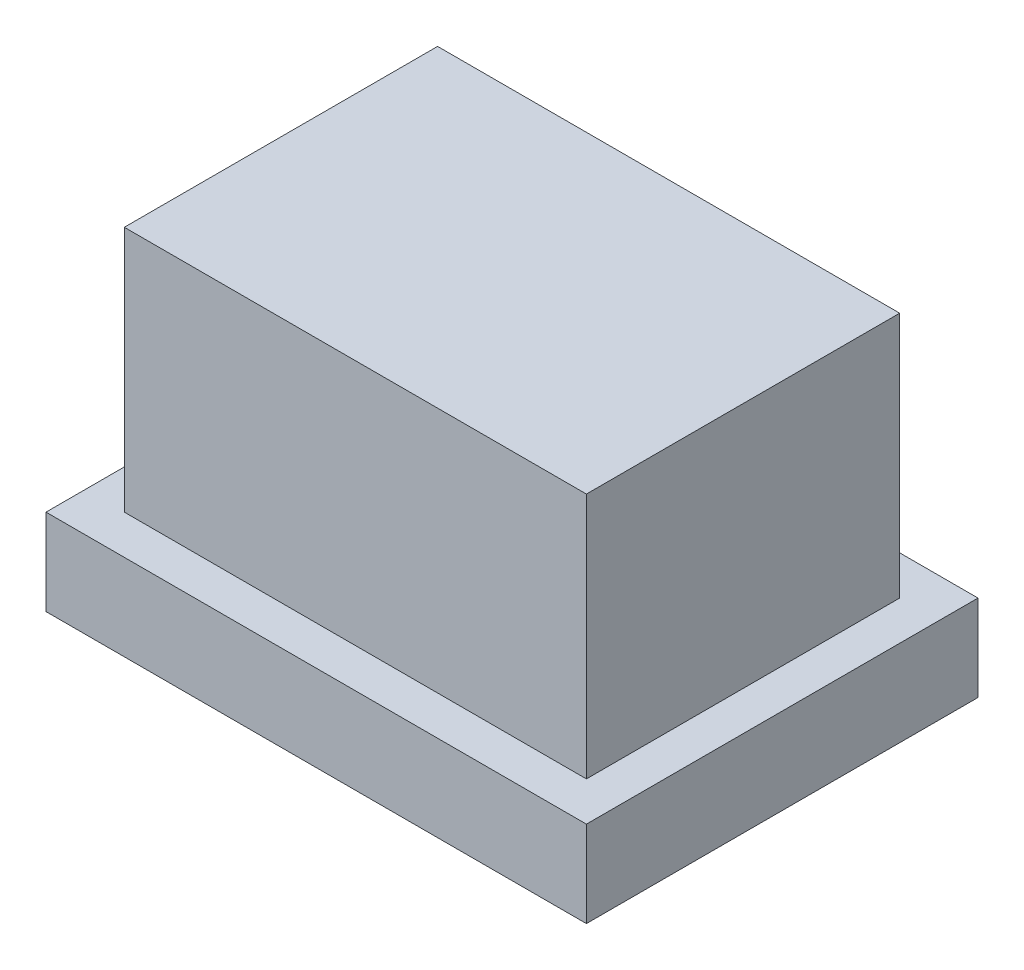
ISO-10303-21;
HEADER;
FILE_DESCRIPTION(('STEP AP214'),'2;1');
FILE_NAME('part.step','',(''),(''),'','','');
FILE_SCHEMA(('AUTOMOTIVE_DESIGN { 1 0 10303 214 1 1 1 1 }'));
ENDSEC;
DATA;
#1=APPLICATION_CONTEXT('core data for automotive mechanical design processes');
#2=APPLICATION_PROTOCOL_DEFINITION('international standard','automotive_design',2000,#1);
#3=PRODUCT_CONTEXT('',#1,'mechanical');
#4=PRODUCT('Part','Part','',(#3));
#5=PRODUCT_RELATED_PRODUCT_CATEGORY('part','',(#4));
#6=PRODUCT_DEFINITION_FORMATION('','',#4);
#7=PRODUCT_DEFINITION_CONTEXT('part definition',#1,'design');
#8=PRODUCT_DEFINITION('design','',#6,#7);
#9=PRODUCT_DEFINITION_SHAPE('','',#8);
#10=(LENGTH_UNIT() NAMED_UNIT(*) SI_UNIT(.MILLI.,.METRE.));
#11=(NAMED_UNIT(*) PLANE_ANGLE_UNIT() SI_UNIT($,.RADIAN.));
#12=(NAMED_UNIT(*) SI_UNIT($,.STERADIAN.) SOLID_ANGLE_UNIT());
#13=UNCERTAINTY_MEASURE_WITH_UNIT(LENGTH_MEASURE(1.E-05),#10,'distance_accuracy_value','');
#14=(GEOMETRIC_REPRESENTATION_CONTEXT(3) GLOBAL_UNCERTAINTY_ASSIGNED_CONTEXT((#13)) GLOBAL_UNIT_ASSIGNED_CONTEXT((#10,
#11,#12)) REPRESENTATION_CONTEXT('',''));
#15=CARTESIAN_POINT('',(0.,0.,0.));
#16=DIRECTION('',(0.,0.,1.));
#17=DIRECTION('',(1.,0.,0.));
#18=AXIS2_PLACEMENT_3D('',#15,#16,#17);
#19=CARTESIAN_POINT('',(6.24469273743017,2.2,4.21787709497206));
#20=DIRECTION('',(-1.,0.,0.));
#21=DIRECTION('',(0.,0.,1.));
#22=AXIS2_PLACEMENT_3D('',#19,#20,#21);
#23=PLANE('',#22);
#24=DIRECTION('',(0.,0.,-1.));
#25=VECTOR('',#24,1.);
#26=CARTESIAN_POINT('',(6.24469273743017,0.,4.21787709497206));
#27=LINE('',#26,#25);
#28=CARTESIAN_POINT('',(6.24469273743017,0.,4.21787709497206));
#29=VERTEX_POINT('',#28);
#30=CARTESIAN_POINT('',(6.24469273743017,0.,-5.78212290502794));
#31=VERTEX_POINT('',#30);
#32=EDGE_CURVE('E127',#29,#31,#27,.T.);
#33=ORIENTED_EDGE('',*,*,#32,.T.);
#34=DIRECTION('',(0.,-1.,0.));
#35=VECTOR('',#34,1.);
#36=CARTESIAN_POINT('',(6.24469273743017,2.2,-5.78212290502794));
#37=LINE('',#36,#35);
#38=CARTESIAN_POINT('',(6.24469273743017,2.2,-5.78212290502794));
#39=VERTEX_POINT('',#38);
#40=EDGE_CURVE('E11',#39,#31,#37,.T.);
#41=ORIENTED_EDGE('',*,*,#40,.F.);
#42=DIRECTION('',(0.,0.,-1.));
#43=VECTOR('',#42,1.);
#44=CARTESIAN_POINT('',(6.24469273743017,2.2,4.21787709497206));
#45=LINE('',#44,#43);
#46=CARTESIAN_POINT('',(6.24469273743017,2.2,4.21787709497206));
#47=VERTEX_POINT('',#46);
#48=EDGE_CURVE('E138',#47,#39,#45,.T.);
#49=ORIENTED_EDGE('',*,*,#48,.F.);
#50=DIRECTION('',(0.,-1.,0.));
#51=VECTOR('',#50,1.);
#52=CARTESIAN_POINT('',(6.24469273743017,2.2,4.21787709497206));
#53=LINE('',#52,#51);
#54=EDGE_CURVE('E151',#47,#29,#53,.T.);
#55=ORIENTED_EDGE('',*,*,#54,.T.);
#56=EDGE_LOOP('',(#33,#41,#49,#55));
#57=FACE_BOUND('',#56,.T.);
#58=ADVANCED_FACE('F39',(#57),#23,.F.);
#59=CARTESIAN_POINT('',(6.24469273743017,2.2,-5.78212290502794));
#60=DIRECTION('',(0.,0.,1.));
#61=DIRECTION('',(1.,0.,0.));
#62=AXIS2_PLACEMENT_3D('',#59,#60,#61);
#63=PLANE('',#62);
#64=DIRECTION('',(-1.,0.,0.));
#65=VECTOR('',#64,1.);
#66=CARTESIAN_POINT('',(6.24469273743017,0.,-5.78212290502794));
#67=LINE('',#66,#65);
#68=CARTESIAN_POINT('',(-7.55530726256983,0.,-5.78212290502794));
#69=VERTEX_POINT('',#68);
#70=EDGE_CURVE('E132',#31,#69,#67,.T.);
#71=ORIENTED_EDGE('',*,*,#70,.T.);
#72=DIRECTION('',(0.,-1.,0.));
#73=VECTOR('',#72,1.);
#74=CARTESIAN_POINT('',(-7.55530726256983,2.2,-5.78212290502794));
#75=LINE('',#74,#73);
#76=CARTESIAN_POINT('',(-7.55530726256983,2.2,-5.78212290502794));
#77=VERTEX_POINT('',#76);
#78=EDGE_CURVE('E47',#77,#69,#75,.T.);
#79=ORIENTED_EDGE('',*,*,#78,.F.);
#80=DIRECTION('',(-1.,0.,0.));
#81=VECTOR('',#80,1.);
#82=CARTESIAN_POINT('',(6.24469273743017,2.2,-5.78212290502794));
#83=LINE('',#82,#81);
#84=EDGE_CURVE('E142',#39,#77,#83,.T.);
#85=ORIENTED_EDGE('',*,*,#84,.F.);
#86=ORIENTED_EDGE('',*,*,#40,.T.);
#87=EDGE_LOOP('',(#71,#79,#85,#86));
#88=FACE_BOUND('',#87,.T.);
#89=ADVANCED_FACE('F188',(#88),#63,.F.);
#90=CARTESIAN_POINT('',(-7.55530726256983,2.2,4.21787709497206));
#91=DIRECTION('',(1.,0.,0.));
#92=DIRECTION('',(0.,0.,-1.));
#93=AXIS2_PLACEMENT_3D('',#90,#91,#92);
#94=PLANE('',#93);
#95=DIRECTION('',(0.,0.,1.));
#96=VECTOR('',#95,1.);
#97=CARTESIAN_POINT('',(-7.55530726256983,0.,4.21787709497206));
#98=LINE('',#97,#96);
#99=CARTESIAN_POINT('',(-7.55530726256983,0.,4.21787709497206));
#100=VERTEX_POINT('',#99);
#101=EDGE_CURVE('E155',#69,#100,#98,.T.);
#102=ORIENTED_EDGE('',*,*,#101,.T.);
#103=DIRECTION('',(0.,-1.,0.));
#104=VECTOR('',#103,1.);
#105=CARTESIAN_POINT('',(-7.55530726256983,2.2,4.21787709497206));
#106=LINE('',#105,#104);
#107=CARTESIAN_POINT('',(-7.55530726256983,2.2,4.21787709497206));
#108=VERTEX_POINT('',#107);
#109=EDGE_CURVE('E163',#108,#100,#106,.T.);
#110=ORIENTED_EDGE('',*,*,#109,.F.);
#111=DIRECTION('',(0.,0.,1.));
#112=VECTOR('',#111,1.);
#113=CARTESIAN_POINT('',(-7.55530726256983,2.2,4.21787709497206));
#114=LINE('',#113,#112);
#115=EDGE_CURVE('E146',#77,#108,#114,.T.);
#116=ORIENTED_EDGE('',*,*,#115,.F.);
#117=ORIENTED_EDGE('',*,*,#78,.T.);
#118=EDGE_LOOP('',(#102,#110,#116,#117));
#119=FACE_BOUND('',#118,.T.);
#120=ADVANCED_FACE('F172',(#119),#94,.F.);
#121=CARTESIAN_POINT('',(6.24469273743017,2.2,4.21787709497206));
#122=DIRECTION('',(0.,0.,-1.));
#123=DIRECTION('',(-1.,0.,0.));
#124=AXIS2_PLACEMENT_3D('',#121,#122,#123);
#125=PLANE('',#124);
#126=DIRECTION('',(1.,0.,0.));
#127=VECTOR('',#126,1.);
#128=CARTESIAN_POINT('',(6.24469273743017,0.,4.21787709497206));
#129=LINE('',#128,#127);
#130=EDGE_CURVE('E143',#100,#29,#129,.T.);
#131=ORIENTED_EDGE('',*,*,#130,.T.);
#132=ORIENTED_EDGE('',*,*,#54,.F.);
#133=DIRECTION('',(1.,0.,0.));
#134=VECTOR('',#133,1.);
#135=CARTESIAN_POINT('',(6.24469273743017,2.2,4.21787709497206));
#136=LINE('',#135,#134);
#137=EDGE_CURVE('E149',#108,#47,#136,.T.);
#138=ORIENTED_EDGE('',*,*,#137,.F.);
#139=ORIENTED_EDGE('',*,*,#109,.T.);
#140=EDGE_LOOP('',(#131,#132,#138,#139));
#141=FACE_BOUND('',#140,.T.);
#142=ADVANCED_FACE('F181',(#141),#125,.F.);
#143=CARTESIAN_POINT('',(0.,2.2,0.));
#144=DIRECTION('',(0.,1.,0.));
#145=DIRECTION('',(0.,0.,1.));
#146=AXIS2_PLACEMENT_3D('',#143,#144,#145);
#147=PLANE('',#146);
#148=DIRECTION('',(1.,0.,0.));
#149=VECTOR('',#148,1.);
#150=CARTESIAN_POINT('',(-6.55530726256983,2.2,3.21787709497206));
#151=LINE('',#150,#149);
#152=CARTESIAN_POINT('',(-6.55530726256983,2.2,3.21787709497206));
#153=VERTEX_POINT('',#152);
#154=CARTESIAN_POINT('',(5.24469273743017,2.2,3.21787709497206));
#155=VERTEX_POINT('',#154);
#156=EDGE_CURVE('E54',#153,#155,#151,.T.);
#157=ORIENTED_EDGE('',*,*,#156,.F.);
#158=DIRECTION('',(0.,0.,1.));
#159=VECTOR('',#158,1.);
#160=CARTESIAN_POINT('',(-6.55530726256983,2.2,-4.78212290502794));
#161=LINE('',#160,#159);
#162=CARTESIAN_POINT('',(-6.55530726256983,2.2,-4.78212290502794));
#163=VERTEX_POINT('',#162);
#164=EDGE_CURVE('E58',#163,#153,#161,.T.);
#165=ORIENTED_EDGE('',*,*,#164,.F.);
#166=DIRECTION('',(-1.,0.,0.));
#167=VECTOR('',#166,1.);
#168=CARTESIAN_POINT('',(5.24469273743017,2.2,-4.78212290502794));
#169=LINE('',#168,#167);
#170=CARTESIAN_POINT('',(5.24469273743017,2.2,-4.78212290502794));
#171=VERTEX_POINT('',#170);
#172=EDGE_CURVE('E246',#171,#163,#169,.T.);
#173=ORIENTED_EDGE('',*,*,#172,.F.);
#174=DIRECTION('',(0.,0.,-1.));
#175=VECTOR('',#174,1.);
#176=CARTESIAN_POINT('',(5.24469273743017,2.2,3.21787709497206));
#177=LINE('',#176,#175);
#178=EDGE_CURVE('E234',#155,#171,#177,.T.);
#179=ORIENTED_EDGE('',*,*,#178,.F.);
#180=EDGE_LOOP('',(#157,#165,#173,#179));
#181=FACE_BOUND('',#180,.T.);
#182=ORIENTED_EDGE('',*,*,#48,.T.);
#183=ORIENTED_EDGE('',*,*,#84,.T.);
#184=ORIENTED_EDGE('',*,*,#115,.T.);
#185=ORIENTED_EDGE('',*,*,#137,.T.);
#186=EDGE_LOOP('',(#182,#183,#184,#185));
#187=FACE_BOUND('',#186,.T.);
#188=ADVANCED_FACE('F187',(#181,#187),#147,.T.);
#189=CARTESIAN_POINT('',(0.,0.,0.));
#190=DIRECTION('',(0.,1.,0.));
#191=DIRECTION('',(0.,0.,1.));
#192=AXIS2_PLACEMENT_3D('',#189,#190,#191);
#193=PLANE('',#192);
#194=CARTESIAN_POINT('',(-0.655307262569832,0.,-0.782122905027936));
#195=DIRECTION('',(0.,-1.,0.));
#196=DIRECTION('',(0.,0.,-1.));
#197=AXIS2_PLACEMENT_3D('',#194,#195,#196);
#198=CIRCLE('',#197,3.5);
#199=CARTESIAN_POINT('',(-0.655307262569832,0.,-4.28212290502794));
#200=VERTEX_POINT('',#199);
#201=EDGE_CURVE('E230',#200,#200,#198,.T.);
#202=ORIENTED_EDGE('',*,*,#201,.F.);
#203=EDGE_LOOP('',(#202));
#204=FACE_BOUND('',#203,.T.);
#205=ORIENTED_EDGE('',*,*,#32,.F.);
#206=ORIENTED_EDGE('',*,*,#130,.F.);
#207=ORIENTED_EDGE('',*,*,#101,.F.);
#208=ORIENTED_EDGE('',*,*,#70,.F.);
#209=EDGE_LOOP('',(#205,#206,#207,#208));
#210=FACE_BOUND('',#209,.T.);
#211=ADVANCED_FACE('F178',(#204,#210),#193,.F.);
#212=CARTESIAN_POINT('',(-6.55530726256983,8.5,3.21787709497206));
#213=DIRECTION('',(0.,0.,-1.));
#214=DIRECTION('',(-1.,0.,0.));
#215=AXIS2_PLACEMENT_3D('',#212,#213,#214);
#216=PLANE('',#215);
#217=ORIENTED_EDGE('',*,*,#156,.T.);
#218=DIRECTION('',(0.,-1.,0.));
#219=VECTOR('',#218,1.);
#220=CARTESIAN_POINT('',(5.24469273743017,8.5,3.21787709497206));
#221=LINE('',#220,#219);
#222=CARTESIAN_POINT('',(5.24469273743017,8.5,3.21787709497206));
#223=VERTEX_POINT('',#222);
#224=EDGE_CURVE('E107',#223,#155,#221,.T.);
#225=ORIENTED_EDGE('',*,*,#224,.F.);
#226=DIRECTION('',(1.,0.,0.));
#227=VECTOR('',#226,1.);
#228=CARTESIAN_POINT('',(-6.55530726256983,8.5,3.21787709497206));
#229=LINE('',#228,#227);
#230=CARTESIAN_POINT('',(-6.55530726256983,8.5,3.21787709497206));
#231=VERTEX_POINT('',#230);
#232=EDGE_CURVE('E114',#231,#223,#229,.T.);
#233=ORIENTED_EDGE('',*,*,#232,.F.);
#234=DIRECTION('',(0.,-1.,0.));
#235=VECTOR('',#234,1.);
#236=CARTESIAN_POINT('',(-6.55530726256983,8.5,3.21787709497206));
#237=LINE('',#236,#235);
#238=EDGE_CURVE('E242',#231,#153,#237,.T.);
#239=ORIENTED_EDGE('',*,*,#238,.T.);
#240=EDGE_LOOP('',(#217,#225,#233,#239));
#241=FACE_BOUND('',#240,.T.);
#242=ADVANCED_FACE('F125',(#241),#216,.F.);
#243=CARTESIAN_POINT('',(5.24469273743017,8.5,3.21787709497206));
#244=DIRECTION('',(-1.,0.,0.));
#245=DIRECTION('',(0.,0.,1.));
#246=AXIS2_PLACEMENT_3D('',#243,#244,#245);
#247=PLANE('',#246);
#248=ORIENTED_EDGE('',*,*,#178,.T.);
#249=DIRECTION('',(0.,-1.,0.));
#250=VECTOR('',#249,1.);
#251=CARTESIAN_POINT('',(5.24469273743017,8.5,-4.78212290502794));
#252=LINE('',#251,#250);
#253=CARTESIAN_POINT('',(5.24469273743017,8.5,-4.78212290502794));
#254=VERTEX_POINT('',#253);
#255=EDGE_CURVE('E109',#254,#171,#252,.T.);
#256=ORIENTED_EDGE('',*,*,#255,.F.);
#257=DIRECTION('',(0.,0.,-1.));
#258=VECTOR('',#257,1.);
#259=CARTESIAN_POINT('',(5.24469273743017,8.5,3.21787709497206));
#260=LINE('',#259,#258);
#261=EDGE_CURVE('E102',#223,#254,#260,.T.);
#262=ORIENTED_EDGE('',*,*,#261,.F.);
#263=ORIENTED_EDGE('',*,*,#224,.T.);
#264=EDGE_LOOP('',(#248,#256,#262,#263));
#265=FACE_BOUND('',#264,.T.);
#266=ADVANCED_FACE('F105',(#265),#247,.F.);
#267=CARTESIAN_POINT('',(5.24469273743017,8.5,-4.78212290502794));
#268=DIRECTION('',(0.,0.,1.));
#269=DIRECTION('',(1.,0.,0.));
#270=AXIS2_PLACEMENT_3D('',#267,#268,#269);
#271=PLANE('',#270);
#272=ORIENTED_EDGE('',*,*,#172,.T.);
#273=DIRECTION('',(0.,-1.,0.));
#274=VECTOR('',#273,1.);
#275=CARTESIAN_POINT('',(-6.55530726256983,8.5,-4.78212290502794));
#276=LINE('',#275,#274);
#277=CARTESIAN_POINT('',(-6.55530726256983,8.5,-4.78212290502794));
#278=VERTEX_POINT('',#277);
#279=EDGE_CURVE('E134',#278,#163,#276,.T.);
#280=ORIENTED_EDGE('',*,*,#279,.F.);
#281=DIRECTION('',(-1.,0.,0.));
#282=VECTOR('',#281,1.);
#283=CARTESIAN_POINT('',(5.24469273743017,8.5,-4.78212290502794));
#284=LINE('',#283,#282);
#285=EDGE_CURVE('E113',#254,#278,#284,.T.);
#286=ORIENTED_EDGE('',*,*,#285,.F.);
#287=ORIENTED_EDGE('',*,*,#255,.T.);
#288=EDGE_LOOP('',(#272,#280,#286,#287));
#289=FACE_BOUND('',#288,.T.);
#290=ADVANCED_FACE('F207',(#289),#271,.F.);
#291=CARTESIAN_POINT('',(-6.55530726256983,8.5,-4.78212290502794));
#292=DIRECTION('',(1.,0.,0.));
#293=DIRECTION('',(0.,0.,-1.));
#294=AXIS2_PLACEMENT_3D('',#291,#292,#293);
#295=PLANE('',#294);
#296=ORIENTED_EDGE('',*,*,#164,.T.);
#297=ORIENTED_EDGE('',*,*,#238,.F.);
#298=DIRECTION('',(0.,0.,1.));
#299=VECTOR('',#298,1.);
#300=CARTESIAN_POINT('',(-6.55530726256983,8.5,-4.78212290502794));
#301=LINE('',#300,#299);
#302=EDGE_CURVE('E119',#278,#231,#301,.T.);
#303=ORIENTED_EDGE('',*,*,#302,.F.);
#304=ORIENTED_EDGE('',*,*,#279,.T.);
#305=EDGE_LOOP('',(#296,#297,#303,#304));
#306=FACE_BOUND('',#305,.T.);
#307=ADVANCED_FACE('F210',(#306),#295,.F.);
#308=CARTESIAN_POINT('',(0.,8.5,0.));
#309=DIRECTION('',(0.,1.,0.));
#310=DIRECTION('',(0.,0.,1.));
#311=AXIS2_PLACEMENT_3D('',#308,#309,#310);
#312=PLANE('',#311);
#313=ORIENTED_EDGE('',*,*,#232,.T.);
#314=ORIENTED_EDGE('',*,*,#261,.T.);
#315=ORIENTED_EDGE('',*,*,#285,.T.);
#316=ORIENTED_EDGE('',*,*,#302,.T.);
#317=EDGE_LOOP('',(#313,#314,#315,#316));
#318=FACE_BOUND('',#317,.T.);
#319=ADVANCED_FACE('F117',(#318),#312,.T.);
#320=CARTESIAN_POINT('',(-0.655307262569832,8.,-0.782122905027936));
#321=DIRECTION('',(0.,-1.,0.));
#322=DIRECTION('',(0.,0.,-1.));
#323=AXIS2_PLACEMENT_3D('',#320,#321,#322);
#324=CYLINDRICAL_SURFACE('',#323,3.5);
#325=CARTESIAN_POINT('',(-0.655307262569832,8.,-0.782122905027936));
#326=DIRECTION('',(0.,-1.,0.));
#327=DIRECTION('',(0.,0.,-1.));
#328=AXIS2_PLACEMENT_3D('',#325,#326,#327);
#329=CIRCLE('',#328,3.5);
#330=CARTESIAN_POINT('',(-0.655307262569832,8.,-4.28212290502794));
#331=VERTEX_POINT('',#330);
#332=EDGE_CURVE('E228',#331,#331,#329,.T.);
#333=ORIENTED_EDGE('',*,*,#332,.F.);
#334=EDGE_LOOP('',(#333));
#335=FACE_BOUND('',#334,.T.);
#336=ORIENTED_EDGE('',*,*,#201,.T.);
#337=EDGE_LOOP('',(#336));
#338=FACE_BOUND('',#337,.T.);
#339=ADVANCED_FACE('F217',(#335,#338),#324,.F.);
#340=CARTESIAN_POINT('',(-0.655307262569832,8.,-0.782122905027936));
#341=DIRECTION('',(0.,-1.,0.));
#342=DIRECTION('',(0.,0.,-1.));
#343=AXIS2_PLACEMENT_3D('',#340,#341,#342);
#344=PLANE('',#343);
#345=ORIENTED_EDGE('',*,*,#332,.T.);
#346=EDGE_LOOP('',(#345));
#347=FACE_BOUND('',#346,.T.);
#348=ADVANCED_FACE('F220',(#347),#344,.T.);
#349=CLOSED_SHELL('',(#58,#89,#120,#142,#188,#211,#242,#266,#290,#307,#319,#339,#348));
#350=MANIFOLD_SOLID_BREP('B2',#349);
#351=ADVANCED_BREP_SHAPE_REPRESENTATION('',(#18,#350),#14);
#352=SHAPE_DEFINITION_REPRESENTATION(#9,#351);
ENDSEC;
END-ISO-10303-21;
